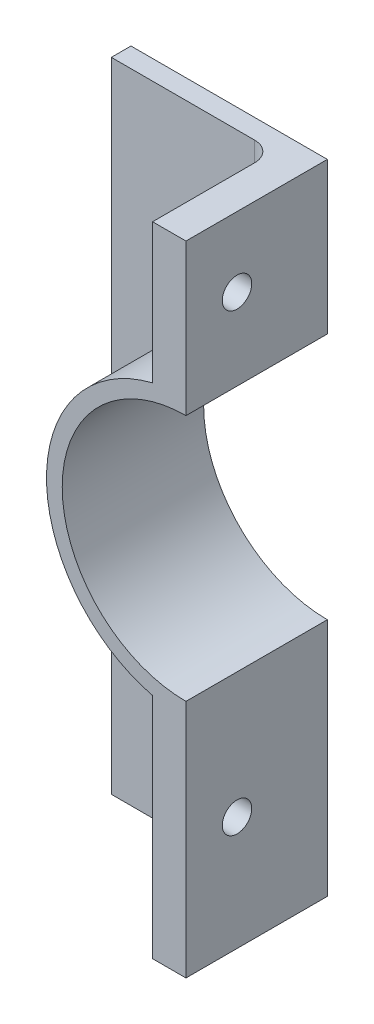
ISO-10303-21;
HEADER;
FILE_DESCRIPTION(('STEP AP214'),'2;1');
FILE_NAME('part.step','',(''),(''),'','','');
FILE_SCHEMA(('AUTOMOTIVE_DESIGN { 1 0 10303 214 1 1 1 1 }'));
ENDSEC;
DATA;
#1=APPLICATION_CONTEXT('core data for automotive mechanical design processes');
#2=APPLICATION_PROTOCOL_DEFINITION('international standard','automotive_design',2000,#1);
#3=PRODUCT_CONTEXT('',#1,'mechanical');
#4=PRODUCT('Part','Part','',(#3));
#5=PRODUCT_RELATED_PRODUCT_CATEGORY('part','',(#4));
#6=PRODUCT_DEFINITION_FORMATION('','',#4);
#7=PRODUCT_DEFINITION_CONTEXT('part definition',#1,'design');
#8=PRODUCT_DEFINITION('design','',#6,#7);
#9=PRODUCT_DEFINITION_SHAPE('','',#8);
#10=(LENGTH_UNIT() NAMED_UNIT(*) SI_UNIT(.MILLI.,.METRE.));
#11=(NAMED_UNIT(*) PLANE_ANGLE_UNIT() SI_UNIT($,.RADIAN.));
#12=(NAMED_UNIT(*) SI_UNIT($,.STERADIAN.) SOLID_ANGLE_UNIT());
#13=UNCERTAINTY_MEASURE_WITH_UNIT(LENGTH_MEASURE(1.E-05),#10,'distance_accuracy_value','');
#14=(GEOMETRIC_REPRESENTATION_CONTEXT(3) GLOBAL_UNCERTAINTY_ASSIGNED_CONTEXT((#13)) GLOBAL_UNIT_ASSIGNED_CONTEXT((#10,
#11,#12)) REPRESENTATION_CONTEXT('',''));
#15=CARTESIAN_POINT('',(0.,0.,0.));
#16=DIRECTION('',(0.,0.,1.));
#17=DIRECTION('',(1.,0.,0.));
#18=AXIS2_PLACEMENT_3D('',#15,#16,#17);
#19=CARTESIAN_POINT('',(0.,82.55,2.54));
#20=DIRECTION('',(0.,1.,0.));
#21=DIRECTION('',(0.,0.,1.));
#22=AXIS2_PLACEMENT_3D('',#19,#20,#21);
#23=PLANE('',#22);
#24=DIRECTION('',(1.,0.,0.));
#25=VECTOR('',#24,1.);
#26=CARTESIAN_POINT('',(0.,82.55,0.));
#27=LINE('',#26,#25);
#28=CARTESIAN_POINT('',(0.,82.55,0.));
#29=VERTEX_POINT('',#28);
#30=CARTESIAN_POINT('',(25.4,82.55,0.));
#31=VERTEX_POINT('',#30);
#32=EDGE_CURVE('E169',#29,#31,#27,.T.);
#33=ORIENTED_EDGE('',*,*,#32,.F.);
#34=DIRECTION('',(0.,0.,-1.));
#35=VECTOR('',#34,1.);
#36=CARTESIAN_POINT('',(0.,82.55,2.54));
#37=LINE('',#36,#35);
#38=CARTESIAN_POINT('',(0.,82.55,2.54));
#39=VERTEX_POINT('',#38);
#40=EDGE_CURVE('E200',#39,#29,#37,.T.);
#41=ORIENTED_EDGE('',*,*,#40,.F.);
#42=DIRECTION('',(1.,0.,0.));
#43=VECTOR('',#42,1.);
#44=CARTESIAN_POINT('',(0.,82.55,2.54));
#45=LINE('',#44,#43);
#46=CARTESIAN_POINT('',(18.542,82.55,2.54));
#47=VERTEX_POINT('',#46);
#48=EDGE_CURVE('E179',#39,#47,#45,.T.);
#49=ORIENTED_EDGE('',*,*,#48,.T.);
#50=CARTESIAN_POINT('',(18.542,82.55,5.08));
#51=DIRECTION('',(0.,1.,0.));
#52=DIRECTION('',(0.,0.,1.));
#53=AXIS2_PLACEMENT_3D('',#50,#51,#52);
#54=CIRCLE('',#53,2.54);
#55=CARTESIAN_POINT('',(21.082,82.55,5.08));
#56=VERTEX_POINT('',#55);
#57=EDGE_CURVE('E60',#47,#56,#54,.F.);
#58=ORIENTED_EDGE('',*,*,#57,.T.);
#59=DIRECTION('',(0.,0.,-1.));
#60=VECTOR('',#59,1.);
#61=CARTESIAN_POINT('',(21.082,82.55,18.288));
#62=LINE('',#61,#60);
#63=CARTESIAN_POINT('',(21.082,82.55,18.288));
#64=VERTEX_POINT('',#63);
#65=EDGE_CURVE('E330',#64,#56,#62,.T.);
#66=ORIENTED_EDGE('',*,*,#65,.F.);
#67=DIRECTION('',(1.,0.,0.));
#68=VECTOR('',#67,1.);
#69=CARTESIAN_POINT('',(0.,82.55,18.288));
#70=LINE('',#69,#68);
#71=CARTESIAN_POINT('',(25.4,82.55,18.288));
#72=VERTEX_POINT('',#71);
#73=EDGE_CURVE('E158',#64,#72,#70,.T.);
#74=ORIENTED_EDGE('',*,*,#73,.T.);
#75=DIRECTION('',(0.,0.,-1.));
#76=VECTOR('',#75,1.);
#77=CARTESIAN_POINT('',(25.4,82.55,18.288));
#78=LINE('',#77,#76);
#79=EDGE_CURVE('E341',#72,#31,#78,.T.);
#80=ORIENTED_EDGE('',*,*,#79,.T.);
#81=EDGE_LOOP('',(#33,#41,#49,#58,#66,#74,#80));
#82=FACE_BOUND('',#81,.T.);
#83=ADVANCED_FACE('F45',(#82),#23,.T.);
#84=CARTESIAN_POINT('',(0.,0.,2.54));
#85=DIRECTION('',(-1.,0.,0.));
#86=DIRECTION('',(0.,0.,1.));
#87=AXIS2_PLACEMENT_3D('',#84,#85,#86);
#88=PLANE('',#87);
#89=DIRECTION('',(0.,1.,0.));
#90=VECTOR('',#89,1.);
#91=CARTESIAN_POINT('',(0.,0.,0.));
#92=LINE('',#91,#90);
#93=CARTESIAN_POINT('',(0.,0.,0.));
#94=VERTEX_POINT('',#93);
#95=EDGE_CURVE('E173',#94,#29,#92,.T.);
#96=ORIENTED_EDGE('',*,*,#95,.F.);
#97=DIRECTION('',(0.,0.,-1.));
#98=VECTOR('',#97,1.);
#99=CARTESIAN_POINT('',(0.,0.,2.54));
#100=LINE('',#99,#98);
#101=CARTESIAN_POINT('',(0.,0.,2.54));
#102=VERTEX_POINT('',#101);
#103=EDGE_CURVE('E190',#102,#94,#100,.T.);
#104=ORIENTED_EDGE('',*,*,#103,.F.);
#105=DIRECTION('',(0.,1.,0.));
#106=VECTOR('',#105,1.);
#107=CARTESIAN_POINT('',(0.,0.,2.54));
#108=LINE('',#107,#106);
#109=EDGE_CURVE('E183',#102,#39,#108,.T.);
#110=ORIENTED_EDGE('',*,*,#109,.T.);
#111=ORIENTED_EDGE('',*,*,#40,.T.);
#112=EDGE_LOOP('',(#96,#104,#110,#111));
#113=FACE_BOUND('',#112,.T.);
#114=ADVANCED_FACE('F244',(#113),#88,.T.);
#115=CARTESIAN_POINT('',(0.,0.,2.54));
#116=DIRECTION('',(0.,-1.,0.));
#117=DIRECTION('',(0.,0.,-1.));
#118=AXIS2_PLACEMENT_3D('',#115,#116,#117);
#119=PLANE('',#118);
#120=DIRECTION('',(-1.,0.,0.));
#121=VECTOR('',#120,1.);
#122=CARTESIAN_POINT('',(0.,0.,0.));
#123=LINE('',#122,#121);
#124=CARTESIAN_POINT('',(25.4,0.,0.));
#125=VERTEX_POINT('',#124);
#126=EDGE_CURVE('E184',#125,#94,#123,.T.);
#127=ORIENTED_EDGE('',*,*,#126,.F.);
#128=DIRECTION('',(0.,0.,-1.));
#129=VECTOR('',#128,1.);
#130=CARTESIAN_POINT('',(25.4,0.,18.288));
#131=LINE('',#130,#129);
#132=CARTESIAN_POINT('',(25.4,0.,18.288));
#133=VERTEX_POINT('',#132);
#134=EDGE_CURVE('E351',#133,#125,#131,.T.);
#135=ORIENTED_EDGE('',*,*,#134,.F.);
#136=DIRECTION('',(-1.,0.,0.));
#137=VECTOR('',#136,1.);
#138=CARTESIAN_POINT('',(0.,0.,18.288));
#139=LINE('',#138,#137);
#140=CARTESIAN_POINT('',(21.082,0.,18.288));
#141=VERTEX_POINT('',#140);
#142=EDGE_CURVE('E315',#133,#141,#139,.T.);
#143=ORIENTED_EDGE('',*,*,#142,.T.);
#144=DIRECTION('',(0.,0.,-1.));
#145=VECTOR('',#144,1.);
#146=CARTESIAN_POINT('',(21.082,0.,18.288));
#147=LINE('',#146,#145);
#148=CARTESIAN_POINT('',(21.082,0.,5.08));
#149=VERTEX_POINT('',#148);
#150=EDGE_CURVE('E175',#141,#149,#147,.T.);
#151=ORIENTED_EDGE('',*,*,#150,.T.);
#152=CARTESIAN_POINT('',(18.542,0.,5.08));
#153=DIRECTION('',(0.,-1.,0.));
#154=DIRECTION('',(0.,0.,-1.));
#155=AXIS2_PLACEMENT_3D('',#152,#153,#154);
#156=CIRCLE('',#155,2.54);
#157=CARTESIAN_POINT('',(18.542,0.,2.54));
#158=VERTEX_POINT('',#157);
#159=EDGE_CURVE('E11',#149,#158,#156,.F.);
#160=ORIENTED_EDGE('',*,*,#159,.T.);
#161=DIRECTION('',(-1.,0.,0.));
#162=VECTOR('',#161,1.);
#163=CARTESIAN_POINT('',(0.,0.,2.54));
#164=LINE('',#163,#162);
#165=EDGE_CURVE('E188',#158,#102,#164,.T.);
#166=ORIENTED_EDGE('',*,*,#165,.T.);
#167=ORIENTED_EDGE('',*,*,#103,.T.);
#168=EDGE_LOOP('',(#127,#135,#143,#151,#160,#166,#167));
#169=FACE_BOUND('',#168,.T.);
#170=ADVANCED_FACE('F249',(#169),#119,.T.);
#171=CARTESIAN_POINT('',(0.,0.,2.54));
#172=DIRECTION('',(0.,0.,1.));
#173=DIRECTION('',(1.,0.,0.));
#174=AXIS2_PLACEMENT_3D('',#171,#172,#173);
#175=PLANE('',#174);
#176=CARTESIAN_POINT('',(25.4,46.99,2.54));
#177=DIRECTION('',(0.,0.,1.));
#178=DIRECTION('',(1.,0.,0.));
#179=AXIS2_PLACEMENT_3D('',#176,#177,#178);
#180=CIRCLE('',#179,20.574);
#181=CARTESIAN_POINT('',(18.542,27.5926467784906,2.54));
#182=VERTEX_POINT('',#181);
#183=CARTESIAN_POINT('',(18.542,66.3873532215094,2.54));
#184=VERTEX_POINT('',#183);
#185=EDGE_CURVE('E208',#182,#184,#180,.F.);
#186=ORIENTED_EDGE('',*,*,#185,.T.);
#187=DIRECTION('',(0.,-1.,0.));
#188=VECTOR('',#187,1.);
#189=CARTESIAN_POINT('',(18.542,0.,2.54));
#190=LINE('',#189,#188);
#191=EDGE_CURVE('E211',#184,#47,#190,.F.);
#192=ORIENTED_EDGE('',*,*,#191,.T.);
#193=ORIENTED_EDGE('',*,*,#48,.F.);
#194=ORIENTED_EDGE('',*,*,#109,.F.);
#195=ORIENTED_EDGE('',*,*,#165,.F.);
#196=DIRECTION('',(0.,1.,0.));
#197=VECTOR('',#196,1.);
#198=CARTESIAN_POINT('',(18.542,29.4805730533521,2.54));
#199=LINE('',#198,#197);
#200=EDGE_CURVE('E205',#158,#182,#199,.T.);
#201=ORIENTED_EDGE('',*,*,#200,.T.);
#202=EDGE_LOOP('',(#186,#192,#193,#194,#195,#201));
#203=FACE_BOUND('',#202,.T.);
#204=ADVANCED_FACE('F256',(#203),#175,.T.);
#205=CARTESIAN_POINT('',(0.,0.,0.));
#206=DIRECTION('',(0.,0.,1.));
#207=DIRECTION('',(1.,0.,0.));
#208=AXIS2_PLACEMENT_3D('',#205,#206,#207);
#209=PLANE('',#208);
#210=ORIENTED_EDGE('',*,*,#32,.T.);
#211=DIRECTION('',(0.,-1.,0.));
#212=VECTOR('',#211,1.);
#213=CARTESIAN_POINT('',(25.4,0.,0.));
#214=LINE('',#213,#212);
#215=CARTESIAN_POINT('',(25.4,62.992,0.));
#216=VERTEX_POINT('',#215);
#217=EDGE_CURVE('E162',#31,#216,#214,.T.);
#218=ORIENTED_EDGE('',*,*,#217,.T.);
#219=CARTESIAN_POINT('',(25.4,46.99,0.));
#220=DIRECTION('',(0.,0.,1.));
#221=DIRECTION('',(1.,0.,0.));
#222=AXIS2_PLACEMENT_3D('',#219,#220,#221);
#223=CIRCLE('',#222,16.002);
#224=CARTESIAN_POINT('',(25.4,30.988,0.));
#225=VERTEX_POINT('',#224);
#226=EDGE_CURVE('E335',#216,#225,#223,.T.);
#227=ORIENTED_EDGE('',*,*,#226,.T.);
#228=EDGE_CURVE('E331',#225,#125,#214,.T.);
#229=ORIENTED_EDGE('',*,*,#228,.T.);
#230=ORIENTED_EDGE('',*,*,#126,.T.);
#231=ORIENTED_EDGE('',*,*,#95,.T.);
#232=EDGE_LOOP('',(#210,#218,#227,#229,#230,#231));
#233=FACE_BOUND('',#232,.T.);
#234=ADVANCED_FACE('F258',(#233),#209,.F.);
#235=CARTESIAN_POINT('',(21.082,0.,18.288));
#236=DIRECTION('',(1.,0.,0.));
#237=DIRECTION('',(0.,0.,-1.));
#238=AXIS2_PLACEMENT_3D('',#235,#236,#237);
#239=PLANE('',#238);
#240=CARTESIAN_POINT('',(21.082,73.524713473324,11.684));
#241=DIRECTION('',(1.,0.,0.));
#242=DIRECTION('',(0.,0.,-1.));
#243=AXIS2_PLACEMENT_3D('',#240,#241,#242);
#244=CIRCLE('',#243,1.905);
#245=CARTESIAN_POINT('',(21.082,73.524713473324,9.779));
#246=VERTEX_POINT('',#245);
#247=EDGE_CURVE('E301',#246,#246,#244,.T.);
#248=ORIENTED_EDGE('',*,*,#247,.T.);
#249=EDGE_LOOP('',(#248));
#250=FACE_BOUND('',#249,.T.);
#251=ORIENTED_EDGE('',*,*,#65,.T.);
#252=DIRECTION('',(0.,-1.,0.));
#253=VECTOR('',#252,1.);
#254=CARTESIAN_POINT('',(21.082,0.,5.08));
#255=LINE('',#254,#253);
#256=CARTESIAN_POINT('',(21.082,64.4994269466479,5.08));
#257=VERTEX_POINT('',#256);
#258=EDGE_CURVE('E167',#56,#257,#255,.T.);
#259=ORIENTED_EDGE('',*,*,#258,.T.);
#260=DIRECTION('',(0.,0.,-1.));
#261=VECTOR('',#260,1.);
#262=CARTESIAN_POINT('',(21.082,64.4994269466479,18.288));
#263=LINE('',#262,#261);
#264=CARTESIAN_POINT('',(21.082,64.4994269466479,18.288));
#265=VERTEX_POINT('',#264);
#266=EDGE_CURVE('E144',#265,#257,#263,.T.);
#267=ORIENTED_EDGE('',*,*,#266,.F.);
#268=DIRECTION('',(0.,-1.,0.));
#269=VECTOR('',#268,1.);
#270=CARTESIAN_POINT('',(21.082,0.,18.288));
#271=LINE('',#270,#269);
#272=EDGE_CURVE('E151',#64,#265,#271,.T.);
#273=ORIENTED_EDGE('',*,*,#272,.F.);
#274=EDGE_LOOP('',(#251,#259,#267,#273));
#275=FACE_BOUND('',#274,.T.);
#276=ADVANCED_FACE('F165',(#250,#275),#239,.F.);
#277=CARTESIAN_POINT('',(25.4,46.99,18.288));
#278=DIRECTION('',(0.,0.,-1.));
#279=DIRECTION('',(-1.,0.,0.));
#280=AXIS2_PLACEMENT_3D('',#277,#278,#279);
#281=CYLINDRICAL_SURFACE('',#280,18.034);
#282=ORIENTED_EDGE('',*,*,#266,.T.);
#283=CARTESIAN_POINT('',(25.4,46.99,5.08));
#284=DIRECTION('',(0.,0.,1.));
#285=DIRECTION('',(1.,0.,0.));
#286=AXIS2_PLACEMENT_3D('',#283,#284,#285);
#287=CIRCLE('',#286,18.034);
#288=CARTESIAN_POINT('',(21.082,29.4805730533521,5.08));
#289=VERTEX_POINT('',#288);
#290=EDGE_CURVE('E76',#257,#289,#287,.T.);
#291=ORIENTED_EDGE('',*,*,#290,.T.);
#292=DIRECTION('',(0.,0.,-1.));
#293=VECTOR('',#292,1.);
#294=CARTESIAN_POINT('',(21.082,29.4805730533521,18.288));
#295=LINE('',#294,#293);
#296=CARTESIAN_POINT('',(21.082,29.4805730533521,18.288));
#297=VERTEX_POINT('',#296);
#298=EDGE_CURVE('E145',#297,#289,#295,.T.);
#299=ORIENTED_EDGE('',*,*,#298,.F.);
#300=CARTESIAN_POINT('',(25.4,46.99,18.288));
#301=DIRECTION('',(0.,0.,1.));
#302=DIRECTION('',(1.,0.,0.));
#303=AXIS2_PLACEMENT_3D('',#300,#301,#302);
#304=CIRCLE('',#303,18.034);
#305=EDGE_CURVE('E140',#265,#297,#304,.T.);
#306=ORIENTED_EDGE('',*,*,#305,.F.);
#307=EDGE_LOOP('',(#282,#291,#299,#306));
#308=FACE_BOUND('',#307,.T.);
#309=ADVANCED_FACE('F142',(#308),#281,.T.);
#310=CARTESIAN_POINT('',(21.082,0.,18.288));
#311=DIRECTION('',(-1.,0.,0.));
#312=DIRECTION('',(0.,0.,1.));
#313=AXIS2_PLACEMENT_3D('',#310,#311,#312);
#314=PLANE('',#313);
#315=CARTESIAN_POINT('',(21.082,14.740286526676,11.684));
#316=DIRECTION('',(-1.,0.,0.));
#317=DIRECTION('',(0.,0.,1.));
#318=AXIS2_PLACEMENT_3D('',#315,#316,#317);
#319=CIRCLE('',#318,1.905);
#320=CARTESIAN_POINT('',(21.082,14.740286526676,13.589));
#321=VERTEX_POINT('',#320);
#322=EDGE_CURVE('E226',#321,#321,#319,.T.);
#323=ORIENTED_EDGE('',*,*,#322,.F.);
#324=EDGE_LOOP('',(#323));
#325=FACE_BOUND('',#324,.T.);
#326=ORIENTED_EDGE('',*,*,#298,.T.);
#327=DIRECTION('',(0.,1.,0.));
#328=VECTOR('',#327,1.);
#329=CARTESIAN_POINT('',(21.082,0.,5.08));
#330=LINE('',#329,#328);
#331=EDGE_CURVE('E68',#289,#149,#330,.F.);
#332=ORIENTED_EDGE('',*,*,#331,.T.);
#333=ORIENTED_EDGE('',*,*,#150,.F.);
#334=DIRECTION('',(0.,1.,0.));
#335=VECTOR('',#334,1.);
#336=CARTESIAN_POINT('',(21.082,0.,18.288));
#337=LINE('',#336,#335);
#338=EDGE_CURVE('E150',#141,#297,#337,.T.);
#339=ORIENTED_EDGE('',*,*,#338,.T.);
#340=EDGE_LOOP('',(#326,#332,#333,#339));
#341=FACE_BOUND('',#340,.T.);
#342=ADVANCED_FACE('F270',(#325,#341),#314,.T.);
#343=CARTESIAN_POINT('',(25.4,0.,18.288));
#344=DIRECTION('',(1.,0.,0.));
#345=DIRECTION('',(0.,0.,-1.));
#346=AXIS2_PLACEMENT_3D('',#343,#344,#345);
#347=PLANE('',#346);
#348=CARTESIAN_POINT('',(25.4,14.740286526676,11.684));
#349=DIRECTION('',(1.,0.,0.));
#350=DIRECTION('',(0.,0.,-1.));
#351=AXIS2_PLACEMENT_3D('',#348,#349,#350);
#352=CIRCLE('',#351,1.905);
#353=CARTESIAN_POINT('',(25.4,14.740286526676,9.779));
#354=VERTEX_POINT('',#353);
#355=EDGE_CURVE('E298',#354,#354,#352,.T.);
#356=ORIENTED_EDGE('',*,*,#355,.F.);
#357=EDGE_LOOP('',(#356));
#358=FACE_BOUND('',#357,.T.);
#359=ORIENTED_EDGE('',*,*,#228,.F.);
#360=DIRECTION('',(0.,0.,-1.));
#361=VECTOR('',#360,1.);
#362=CARTESIAN_POINT('',(25.4,30.988,18.288));
#363=LINE('',#362,#361);
#364=CARTESIAN_POINT('',(25.4,30.988,18.288));
#365=VERTEX_POINT('',#364);
#366=EDGE_CURVE('E348',#365,#225,#363,.T.);
#367=ORIENTED_EDGE('',*,*,#366,.F.);
#368=DIRECTION('',(0.,-1.,0.));
#369=VECTOR('',#368,1.);
#370=CARTESIAN_POINT('',(25.4,0.,18.288));
#371=LINE('',#370,#369);
#372=EDGE_CURVE('E319',#365,#133,#371,.T.);
#373=ORIENTED_EDGE('',*,*,#372,.T.);
#374=ORIENTED_EDGE('',*,*,#134,.T.);
#375=EDGE_LOOP('',(#359,#367,#373,#374));
#376=FACE_BOUND('',#375,.T.);
#377=ADVANCED_FACE('F273',(#358,#376),#347,.T.);
#378=CARTESIAN_POINT('',(25.4,46.99,18.288));
#379=DIRECTION('',(0.,0.,-1.));
#380=DIRECTION('',(-1.,0.,0.));
#381=AXIS2_PLACEMENT_3D('',#378,#379,#380);
#382=CYLINDRICAL_SURFACE('',#381,16.002);
#383=ORIENTED_EDGE('',*,*,#226,.F.);
#384=DIRECTION('',(0.,0.,-1.));
#385=VECTOR('',#384,1.);
#386=CARTESIAN_POINT('',(25.4,62.992,18.288));
#387=LINE('',#386,#385);
#388=CARTESIAN_POINT('',(25.4,62.992,18.288));
#389=VERTEX_POINT('',#388);
#390=EDGE_CURVE('E345',#389,#216,#387,.T.);
#391=ORIENTED_EDGE('',*,*,#390,.F.);
#392=CARTESIAN_POINT('',(25.4,46.99,18.288));
#393=DIRECTION('',(0.,0.,1.));
#394=DIRECTION('',(1.,0.,0.));
#395=AXIS2_PLACEMENT_3D('',#392,#393,#394);
#396=CIRCLE('',#395,16.002);
#397=EDGE_CURVE('E323',#389,#365,#396,.T.);
#398=ORIENTED_EDGE('',*,*,#397,.T.);
#399=ORIENTED_EDGE('',*,*,#366,.T.);
#400=EDGE_LOOP('',(#383,#391,#398,#399));
#401=FACE_BOUND('',#400,.T.);
#402=ADVANCED_FACE('F275',(#401),#382,.F.);
#403=CARTESIAN_POINT('',(25.4,73.524713473324,11.684));
#404=DIRECTION('',(1.,0.,0.));
#405=DIRECTION('',(0.,0.,-1.));
#406=AXIS2_PLACEMENT_3D('',#403,#404,#405);
#407=CIRCLE('',#406,1.905);
#408=CARTESIAN_POINT('',(25.4,73.524713473324,9.779));
#409=VERTEX_POINT('',#408);
#410=EDGE_CURVE('E302',#409,#409,#407,.T.);
#411=ORIENTED_EDGE('',*,*,#410,.F.);
#412=EDGE_LOOP('',(#411));
#413=FACE_BOUND('',#412,.T.);
#414=ORIENTED_EDGE('',*,*,#217,.F.);
#415=ORIENTED_EDGE('',*,*,#79,.F.);
#416=EDGE_CURVE('E324',#72,#389,#371,.T.);
#417=ORIENTED_EDGE('',*,*,#416,.T.);
#418=ORIENTED_EDGE('',*,*,#390,.T.);
#419=EDGE_LOOP('',(#414,#415,#417,#418));
#420=FACE_BOUND('',#419,.T.);
#421=ADVANCED_FACE('F278',(#413,#420),#347,.T.);
#422=CARTESIAN_POINT('',(0.,0.,18.288));
#423=DIRECTION('',(0.,0.,1.));
#424=DIRECTION('',(1.,0.,0.));
#425=AXIS2_PLACEMENT_3D('',#422,#423,#424);
#426=PLANE('',#425);
#427=ORIENTED_EDGE('',*,*,#272,.T.);
#428=ORIENTED_EDGE('',*,*,#305,.T.);
#429=ORIENTED_EDGE('',*,*,#338,.F.);
#430=ORIENTED_EDGE('',*,*,#142,.F.);
#431=ORIENTED_EDGE('',*,*,#372,.F.);
#432=ORIENTED_EDGE('',*,*,#397,.F.);
#433=ORIENTED_EDGE('',*,*,#416,.F.);
#434=ORIENTED_EDGE('',*,*,#73,.F.);
#435=EDGE_LOOP('',(#427,#428,#429,#430,#431,#432,#433,#434));
#436=FACE_BOUND('',#435,.T.);
#437=ADVANCED_FACE('F155',(#436),#426,.T.);
#438=CARTESIAN_POINT('',(18.542,0.,5.08));
#439=DIRECTION('',(0.,-1.,0.));
#440=DIRECTION('',(0.,0.,-1.));
#441=AXIS2_PLACEMENT_3D('',#438,#439,#440);
#442=CYLINDRICAL_SURFACE('',#441,2.54);
#443=ORIENTED_EDGE('',*,*,#159,.F.);
#444=ORIENTED_EDGE('',*,*,#331,.F.);
#445=CARTESIAN_POINT('',(21.082,29.4805730533521,5.08));
#446=CARTESIAN_POINT('',(21.0820129244465,29.4805842131332,5.01902551348322));
#447=CARTESIAN_POINT('',(21.0798048114013,29.4788534759707,4.95805992742463));
#448=CARTESIAN_POINT('',(21.0710458763671,29.471993638602,4.83666739547745));
#449=CARTESIAN_POINT('',(21.0644975019261,29.466866453712,4.77624016545285));
#450=CARTESIAN_POINT('',(21.0472125963212,29.4533423146423,4.65675827025604));
#451=CARTESIAN_POINT('',(21.0365030894622,29.4449664594257,4.59769730252414));
#452=CARTESIAN_POINT('',(21.0110804655574,29.425103323613,4.48098947118643));
#453=CARTESIAN_POINT('',(20.9963669799112,29.4136157565575,4.42334273830592));
#454=CARTESIAN_POINT('',(20.9466026623215,29.3748098631431,4.25333605531588));
#455=CARTESIAN_POINT('',(20.9058763420405,29.3431077630395,4.14356420590233));
#456=CARTESIAN_POINT('',(20.8113730641539,29.2698079274389,3.93331311585028));
#457=CARTESIAN_POINT('',(20.7575765787056,29.2281953868271,3.83284809350339));
#458=CARTESIAN_POINT('',(20.6344641252383,29.1333695741083,3.63507801502231));
#459=CARTESIAN_POINT('',(20.5642600852721,29.0795011402434,3.53864359460705));
#460=CARTESIAN_POINT('',(20.4137316602202,28.9645936269322,3.3589603077969));
#461=CARTESIAN_POINT('',(20.3334052557535,28.9035531168433,3.275714079907));
#462=CARTESIAN_POINT('',(20.1474416286177,28.7630223034998,3.10693595357619));
#463=CARTESIAN_POINT('',(20.0399884901133,28.682312503706,3.02442169966884));
#464=CARTESIAN_POINT('',(19.8163615659276,28.5155310263321,2.87876314977381));
#465=CARTESIAN_POINT('',(19.7001771193977,28.4294528165117,2.81564302827231));
#466=CARTESIAN_POINT('',(19.4379683160518,28.2365965972382,2.69811570634427));
#467=CARTESIAN_POINT('',(19.2905911659299,28.1290951458482,2.64790950507683));
#468=CARTESIAN_POINT('',(18.9907700991376,27.912306835968,2.57521636921351));
#469=CARTESIAN_POINT('',(18.8383353455326,27.8030233711381,2.55268184558765));
#470=CARTESIAN_POINT('',(18.6402865916244,27.6622443455751,2.54150524908516));
#471=CARTESIAN_POINT('',(18.5954015264192,27.6304180929449,2.54016401882533));
#472=CARTESIAN_POINT('',(18.547650514468,27.5966426050298,2.54000471614421));
#473=CARTESIAN_POINT('',(18.5448253347634,27.5946445927006,2.54000000228932));
#474=CARTESIAN_POINT('',(18.542,27.5926467784906,2.54));
#475=B_SPLINE_CURVE_WITH_KNOTS('',3,(#445,#446,#447,#448,#449,#450,#451,#452,#453,#454,#455,
#456,#457,#458,#459,#460,#461,#462,#463,#464,#465,#466,#467,#468,#469,#470,#471,#472,#473,#474),
.UNSPECIFIED.,.F.,.F.,(4,2,2,2,2,2,2,2,2,2,2,2,2,2,4),(0.,0.182844331911327,0.36558564238831,
0.547159466912744,0.728750012516879,1.09089003578539,1.45357448817016,1.84479641774465,
2.23609651883415,2.70746288858523,3.17941444770126,3.74483032909135,4.30927245496242,
4.47435907852633,4.48473998763801),.UNSPECIFIED.);
#476=EDGE_CURVE('E50',#182,#289,#475,.F.);
#477=ORIENTED_EDGE('',*,*,#476,.F.);
#478=ORIENTED_EDGE('',*,*,#200,.F.);
#479=EDGE_LOOP('',(#443,#444,#477,#478));
#480=FACE_BOUND('',#479,.T.);
#481=ADVANCED_FACE('F47',(#480),#442,.F.);
#482=CARTESIAN_POINT('',(25.4,46.99,5.08));
#483=DIRECTION('',(0.,0.,1.));
#484=DIRECTION('',(1.,0.,0.));
#485=AXIS2_PLACEMENT_3D('',#482,#483,#484);
#486=TOROIDAL_SURFACE('',#485,20.574,2.54);
#487=ORIENTED_EDGE('',*,*,#476,.T.);
#488=ORIENTED_EDGE('',*,*,#290,.F.);
#489=CARTESIAN_POINT('',(21.082,64.4994269466479,5.08));
#490=CARTESIAN_POINT('',(21.0820129244465,64.4994157868668,5.01902551348322));
#491=CARTESIAN_POINT('',(21.0798048114013,64.5011465240293,4.95805992742462));
#492=CARTESIAN_POINT('',(21.0710458763671,64.508006361398,4.83666739547745));
#493=CARTESIAN_POINT('',(21.0644975019261,64.513133546288,4.77624016545285));
#494=CARTESIAN_POINT('',(21.0472125963212,64.5266576853577,4.65675827025604));
#495=CARTESIAN_POINT('',(21.0365030894622,64.5350335405743,4.59769730252414));
#496=CARTESIAN_POINT('',(21.0110804655574,64.5548966763871,4.48098947118643));
#497=CARTESIAN_POINT('',(20.9963669799112,64.5663842434425,4.42334273830592));
#498=CARTESIAN_POINT('',(20.9466026623215,64.6051901368569,4.25333605531588));
#499=CARTESIAN_POINT('',(20.9058763420405,64.6368922369605,4.14356420590233));
#500=CARTESIAN_POINT('',(20.8113730641539,64.7101920725611,3.93331311585028));
#501=CARTESIAN_POINT('',(20.7575765787056,64.7518046131729,3.83284809350339));
#502=CARTESIAN_POINT('',(20.6344641252383,64.8466304258917,3.63507801502231));
#503=CARTESIAN_POINT('',(20.5642600852721,64.9004988597566,3.53864359460705));
#504=CARTESIAN_POINT('',(20.4137316602202,65.0154063730678,3.3589603077969));
#505=CARTESIAN_POINT('',(20.3334052557535,65.0764468831567,3.275714079907));
#506=CARTESIAN_POINT('',(20.1474416286177,65.2169776965002,3.10693595357619));
#507=CARTESIAN_POINT('',(20.0399884901133,65.2976874962939,3.02442169966884));
#508=CARTESIAN_POINT('',(19.8163615659276,65.4644689736679,2.87876314977381));
#509=CARTESIAN_POINT('',(19.7001771193977,65.5505471834884,2.81564302827231));
#510=CARTESIAN_POINT('',(19.4379683160517,65.7434034027617,2.69811570634427));
#511=CARTESIAN_POINT('',(19.2905911659296,65.8509048541514,2.64790950507683));
#512=CARTESIAN_POINT('',(18.9907700991379,66.0676931640325,2.57521636921351));
#513=CARTESIAN_POINT('',(18.8383353455337,66.1769766288634,2.55268184558765));
#514=CARTESIAN_POINT('',(18.6402865916241,66.3177556544244,2.54150524908516));
#515=CARTESIAN_POINT('',(18.5954015264184,66.349581907054,2.54016401882533));
#516=CARTESIAN_POINT('',(18.5476505144679,66.3833573949701,2.54000471614421));
#517=CARTESIAN_POINT('',(18.5448253347634,66.3853554072993,2.54000000228933));
#518=CARTESIAN_POINT('',(18.542,66.3873532215094,2.54));
#519=B_SPLINE_CURVE_WITH_KNOTS('',3,(#489,#490,#491,#492,#493,#494,#495,#496,#497,#498,#499,
#500,#501,#502,#503,#504,#505,#506,#507,#508,#509,#510,#511,#512,#513,#514,#515,#516,#517,#518),
.UNSPECIFIED.,.F.,.F.,(4,2,2,2,2,2,2,2,2,2,2,2,2,2,4),(0.,0.182844331911329,0.365585642388311,
0.547159466912743,0.72875001251688,1.09089003578539,1.45357448817016,1.84479641774465,
2.23609651883414,2.70746288858522,3.17941444770127,3.74483032909137,4.30927245496242,
4.47435907852633,4.48473998763801),.UNSPECIFIED.);
#520=EDGE_CURVE('E219',#184,#257,#519,.F.);
#521=ORIENTED_EDGE('',*,*,#520,.F.);
#522=ORIENTED_EDGE('',*,*,#185,.F.);
#523=EDGE_LOOP('',(#487,#488,#521,#522));
#524=FACE_BOUND('',#523,.T.);
#525=ADVANCED_FACE('F230',(#524),#486,.F.);
#526=CARTESIAN_POINT('',(18.542,0.,5.08));
#527=DIRECTION('',(0.,-1.,0.));
#528=DIRECTION('',(0.,0.,-1.));
#529=AXIS2_PLACEMENT_3D('',#526,#527,#528);
#530=CYLINDRICAL_SURFACE('',#529,2.54);
#531=ORIENTED_EDGE('',*,*,#57,.F.);
#532=ORIENTED_EDGE('',*,*,#191,.F.);
#533=ORIENTED_EDGE('',*,*,#520,.T.);
#534=ORIENTED_EDGE('',*,*,#258,.F.);
#535=EDGE_LOOP('',(#531,#532,#533,#534));
#536=FACE_BOUND('',#535,.T.);
#537=ADVANCED_FACE('F227',(#536),#530,.F.);
#538=CARTESIAN_POINT('',(-1.2E-05,73.524713473324,11.684));
#539=DIRECTION('',(1.,0.,0.));
#540=DIRECTION('',(0.,0.,-1.));
#541=AXIS2_PLACEMENT_3D('',#538,#539,#540);
#542=CYLINDRICAL_SURFACE('',#541,1.905);
#543=ORIENTED_EDGE('',*,*,#410,.T.);
#544=EDGE_LOOP('',(#543));
#545=FACE_BOUND('',#544,.T.);
#546=ORIENTED_EDGE('',*,*,#247,.F.);
#547=EDGE_LOOP('',(#546));
#548=FACE_BOUND('',#547,.T.);
#549=ADVANCED_FACE('F239',(#545,#548),#542,.F.);
#550=CARTESIAN_POINT('',(-1.2E-05,14.740286526676,11.684));
#551=DIRECTION('',(1.,0.,0.));
#552=DIRECTION('',(0.,0.,-1.));
#553=AXIS2_PLACEMENT_3D('',#550,#551,#552);
#554=CYLINDRICAL_SURFACE('',#553,1.905);
#555=ORIENTED_EDGE('',*,*,#322,.T.);
#556=EDGE_LOOP('',(#555));
#557=FACE_BOUND('',#556,.T.);
#558=ORIENTED_EDGE('',*,*,#355,.T.);
#559=EDGE_LOOP('',(#558));
#560=FACE_BOUND('',#559,.T.);
#561=ADVANCED_FACE('F287',(#557,#560),#554,.F.);
#562=CLOSED_SHELL('',(#83,#114,#170,#204,#234,#276,#309,#342,#377,#402,#421,#437,#481,#525,#537,
#549,#561));
#563=MANIFOLD_SOLID_BREP('B2',#562);
#564=ADVANCED_BREP_SHAPE_REPRESENTATION('',(#18,#563),#14);
#565=SHAPE_DEFINITION_REPRESENTATION(#9,#564);
ENDSEC;
END-ISO-10303-21;
